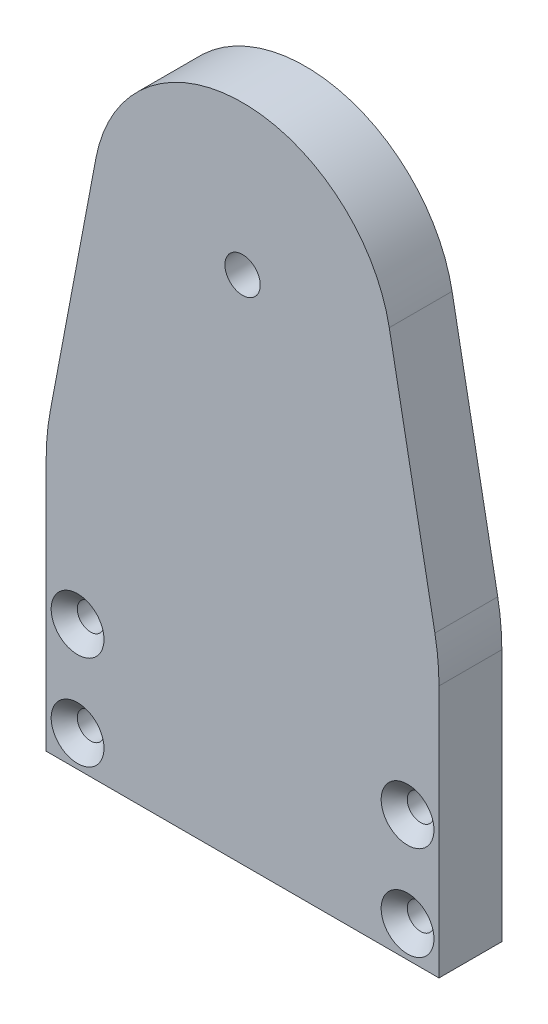
ISO-10303-21;
HEADER;
FILE_DESCRIPTION(('STEP AP214'),'2;1');
FILE_NAME('part.step','',(''),(''),'','','');
FILE_SCHEMA(('AUTOMOTIVE_DESIGN { 1 0 10303 214 1 1 1 1 }'));
ENDSEC;
DATA;
#1=APPLICATION_CONTEXT('core data for automotive mechanical design processes');
#2=APPLICATION_PROTOCOL_DEFINITION('international standard','automotive_design',2000,#1);
#3=PRODUCT_CONTEXT('',#1,'mechanical');
#4=PRODUCT('Part','Part','',(#3));
#5=PRODUCT_RELATED_PRODUCT_CATEGORY('part','',(#4));
#6=PRODUCT_DEFINITION_FORMATION('','',#4);
#7=PRODUCT_DEFINITION_CONTEXT('part definition',#1,'design');
#8=PRODUCT_DEFINITION('design','',#6,#7);
#9=PRODUCT_DEFINITION_SHAPE('','',#8);
#10=(LENGTH_UNIT() NAMED_UNIT(*) SI_UNIT(.MILLI.,.METRE.));
#11=(NAMED_UNIT(*) PLANE_ANGLE_UNIT() SI_UNIT($,.RADIAN.));
#12=(NAMED_UNIT(*) SI_UNIT($,.STERADIAN.) SOLID_ANGLE_UNIT());
#13=UNCERTAINTY_MEASURE_WITH_UNIT(LENGTH_MEASURE(1.E-05),#10,'distance_accuracy_value','');
#14=(GEOMETRIC_REPRESENTATION_CONTEXT(3) GLOBAL_UNCERTAINTY_ASSIGNED_CONTEXT((#13)) GLOBAL_UNIT_ASSIGNED_CONTEXT((#10,
#11,#12)) REPRESENTATION_CONTEXT('',''));
#15=CARTESIAN_POINT('',(0.,0.,0.));
#16=DIRECTION('',(0.,0.,1.));
#17=DIRECTION('',(1.,0.,0.));
#18=AXIS2_PLACEMENT_3D('',#15,#16,#17);
#19=CARTESIAN_POINT('',(54.6597712012296,10.3203083429222,8.));
#20=DIRECTION('',(-0.982638246920603,-0.185531872433835,0.));
#21=DIRECTION('',(0.185531872433835,-0.982638246920603,0.));
#22=AXIS2_PLACEMENT_3D('',#19,#20,#21);
#23=PLANE('',#22);
#24=DIRECTION('',(-0.185531872433835,0.982638246920603,0.));
#25=VECTOR('',#24,1.);
#26=CARTESIAN_POINT('',(54.6597712012296,10.3203083429222,8.));
#27=LINE('',#26,#25);
#28=CARTESIAN_POINT('',(49.4791474076181,37.7586078422442,8.));
#29=VERTEX_POINT('',#28);
#30=CARTESIAN_POINT('',(43.6701266914915,68.5251055762429,8.));
#31=VERTEX_POINT('',#30);
#32=EDGE_CURVE('E189',#29,#31,#27,.T.);
#33=ORIENTED_EDGE('',*,*,#32,.F.);
#34=DIRECTION('',(0.,0.,-1.));
#35=VECTOR('',#34,1.);
#36=CARTESIAN_POINT('',(49.4791474076181,37.7586078422442,8.));
#37=LINE('',#36,#35);
#38=CARTESIAN_POINT('',(49.4791474076181,37.7586078422442,0.));
#39=VERTEX_POINT('',#38);
#40=EDGE_CURVE('E58',#29,#39,#37,.T.);
#41=ORIENTED_EDGE('',*,*,#40,.T.);
#42=DIRECTION('',(-0.185531872433835,0.982638246920603,0.));
#43=VECTOR('',#42,1.);
#44=CARTESIAN_POINT('',(54.6597712012296,10.3203083429222,0.));
#45=LINE('',#44,#43);
#46=CARTESIAN_POINT('',(43.6701266914915,68.5251055762429,0.));
#47=VERTEX_POINT('',#46);
#48=EDGE_CURVE('E186',#39,#47,#45,.T.);
#49=ORIENTED_EDGE('',*,*,#48,.T.);
#50=DIRECTION('',(0.,0.,-1.));
#51=VECTOR('',#50,1.);
#52=CARTESIAN_POINT('',(43.6701266914915,68.5251055762429,8.));
#53=LINE('',#52,#51);
#54=EDGE_CURVE('E224',#31,#47,#53,.T.);
#55=ORIENTED_EDGE('',*,*,#54,.F.);
#56=EDGE_LOOP('',(#33,#41,#49,#55));
#57=FACE_BOUND('',#56,.T.);
#58=ADVANCED_FACE('F50',(#57),#23,.F.);
#59=CARTESIAN_POINT('',(25.,65.,8.));
#60=DIRECTION('',(0.,0.,-1.));
#61=DIRECTION('',(-1.,0.,0.));
#62=AXIS2_PLACEMENT_3D('',#59,#60,#61);
#63=CYLINDRICAL_SURFACE('',#62,19.);
#64=CARTESIAN_POINT('',(25.,65.,0.));
#65=DIRECTION('',(0.,0.,1.));
#66=DIRECTION('',(1.,0.,0.));
#67=AXIS2_PLACEMENT_3D('',#64,#65,#66);
#68=CIRCLE('',#67,19.);
#69=CARTESIAN_POINT('',(6.32987330850855,68.5251055762429,0.));
#70=VERTEX_POINT('',#69);
#71=EDGE_CURVE('E206',#47,#70,#68,.T.);
#72=ORIENTED_EDGE('',*,*,#71,.T.);
#73=DIRECTION('',(0.,0.,-1.));
#74=VECTOR('',#73,1.);
#75=CARTESIAN_POINT('',(6.32987330850855,68.5251055762429,8.));
#76=LINE('',#75,#74);
#77=CARTESIAN_POINT('',(6.32987330850855,68.5251055762429,8.));
#78=VERTEX_POINT('',#77);
#79=EDGE_CURVE('E221',#78,#70,#76,.T.);
#80=ORIENTED_EDGE('',*,*,#79,.F.);
#81=CARTESIAN_POINT('',(25.,65.,8.));
#82=DIRECTION('',(0.,0.,1.));
#83=DIRECTION('',(1.,0.,0.));
#84=AXIS2_PLACEMENT_3D('',#81,#82,#83);
#85=CIRCLE('',#84,19.);
#86=EDGE_CURVE('E191',#31,#78,#85,.T.);
#87=ORIENTED_EDGE('',*,*,#86,.F.);
#88=ORIENTED_EDGE('',*,*,#54,.T.);
#89=EDGE_LOOP('',(#72,#80,#87,#88));
#90=FACE_BOUND('',#89,.T.);
#91=ADVANCED_FACE('F252',(#90),#63,.T.);
#92=CARTESIAN_POINT('',(-6.38087498566982,1.20477264910817,8.));
#93=DIRECTION('',(-0.982638246920603,0.185531872433835,0.));
#94=DIRECTION('',(-0.185531872433835,-0.982638246920603,0.));
#95=AXIS2_PLACEMENT_3D('',#92,#93,#94);
#96=PLANE('',#95);
#97=DIRECTION('',(0.185531872433835,0.982638246920603,0.));
#98=VECTOR('',#97,1.);
#99=CARTESIAN_POINT('',(-6.38087498566982,1.20477264910817,0.));
#100=LINE('',#99,#98);
#101=CARTESIAN_POINT('',(0.520852592381923,37.7586078422442,0.));
#102=VERTEX_POINT('',#101);
#103=EDGE_CURVE('E209',#102,#70,#100,.T.);
#104=ORIENTED_EDGE('',*,*,#103,.F.);
#105=DIRECTION('',(0.,0.,-1.));
#106=VECTOR('',#105,1.);
#107=CARTESIAN_POINT('',(0.520852592381923,37.7586078422442,8.));
#108=LINE('',#107,#106);
#109=CARTESIAN_POINT('',(0.520852592381923,37.7586078422442,8.));
#110=VERTEX_POINT('',#109);
#111=EDGE_CURVE('E234',#102,#110,#108,.F.);
#112=ORIENTED_EDGE('',*,*,#111,.T.);
#113=DIRECTION('',(0.185531872433835,0.982638246920603,0.));
#114=VECTOR('',#113,1.);
#115=CARTESIAN_POINT('',(-6.38087498566982,1.20477264910817,8.));
#116=LINE('',#115,#114);
#117=EDGE_CURVE('E195',#110,#78,#116,.T.);
#118=ORIENTED_EDGE('',*,*,#117,.T.);
#119=ORIENTED_EDGE('',*,*,#79,.T.);
#120=EDGE_LOOP('',(#104,#112,#118,#119));
#121=FACE_BOUND('',#120,.T.);
#122=ADVANCED_FACE('F285',(#121),#96,.T.);
#123=CARTESIAN_POINT('',(0.,0.,8.));
#124=DIRECTION('',(-1.,0.,0.));
#125=DIRECTION('',(0.,0.,1.));
#126=AXIS2_PLACEMENT_3D('',#123,#124,#125);
#127=PLANE('',#126);
#128=DIRECTION('',(0.,1.,0.));
#129=VECTOR('',#128,1.);
#130=CARTESIAN_POINT('',(0.,0.,8.));
#131=LINE('',#130,#129);
#132=CARTESIAN_POINT('',(0.,0.,8.));
#133=VERTEX_POINT('',#132);
#134=CARTESIAN_POINT('',(0.,32.1926516692291,8.));
#135=VERTEX_POINT('',#134);
#136=EDGE_CURVE('E197',#133,#135,#131,.T.);
#137=ORIENTED_EDGE('',*,*,#136,.T.);
#138=DIRECTION('',(0.,0.,-1.));
#139=VECTOR('',#138,1.);
#140=CARTESIAN_POINT('',(0.,32.1926516692291,8.));
#141=LINE('',#140,#139);
#142=CARTESIAN_POINT('',(0.,32.1926516692291,0.));
#143=VERTEX_POINT('',#142);
#144=EDGE_CURVE('E227',#135,#143,#141,.T.);
#145=ORIENTED_EDGE('',*,*,#144,.T.);
#146=DIRECTION('',(0.,1.,0.));
#147=VECTOR('',#146,1.);
#148=CARTESIAN_POINT('',(0.,0.,0.));
#149=LINE('',#148,#147);
#150=CARTESIAN_POINT('',(0.,0.,0.));
#151=VERTEX_POINT('',#150);
#152=EDGE_CURVE('E211',#151,#143,#149,.T.);
#153=ORIENTED_EDGE('',*,*,#152,.F.);
#154=DIRECTION('',(0.,0.,-1.));
#155=VECTOR('',#154,1.);
#156=CARTESIAN_POINT('',(0.,0.,8.));
#157=LINE('',#156,#155);
#158=EDGE_CURVE('E219',#133,#151,#157,.T.);
#159=ORIENTED_EDGE('',*,*,#158,.F.);
#160=EDGE_LOOP('',(#137,#145,#153,#159));
#161=FACE_BOUND('',#160,.T.);
#162=ADVANCED_FACE('F264',(#161),#127,.T.);
#163=CARTESIAN_POINT('',(0.,0.,8.));
#164=DIRECTION('',(0.,1.,0.));
#165=DIRECTION('',(0.,0.,1.));
#166=AXIS2_PLACEMENT_3D('',#163,#164,#165);
#167=PLANE('',#166);
#168=CARTESIAN_POINT('',(38.,0.,4.));
#169=DIRECTION('',(0.,-1.,0.));
#170=DIRECTION('',(0.,0.,-1.));
#171=AXIS2_PLACEMENT_3D('',#168,#169,#170);
#172=CIRCLE('',#171,1.24999999999999);
#173=CARTESIAN_POINT('',(38.,0.,2.75000000000001));
#174=VERTEX_POINT('',#173);
#175=EDGE_CURVE('E130',#174,#174,#172,.T.);
#176=ORIENTED_EDGE('',*,*,#175,.F.);
#177=EDGE_LOOP('',(#176));
#178=FACE_BOUND('',#177,.T.);
#179=CARTESIAN_POINT('',(12.,0.,4.));
#180=DIRECTION('',(0.,-1.,0.));
#181=DIRECTION('',(0.,0.,-1.));
#182=AXIS2_PLACEMENT_3D('',#179,#180,#181);
#183=CIRCLE('',#182,1.24999999999999);
#184=CARTESIAN_POINT('',(12.,0.,2.75000000000001));
#185=VERTEX_POINT('',#184);
#186=EDGE_CURVE('E129',#185,#185,#183,.T.);
#187=ORIENTED_EDGE('',*,*,#186,.F.);
#188=EDGE_LOOP('',(#187));
#189=FACE_BOUND('',#188,.T.);
#190=DIRECTION('',(1.,0.,0.));
#191=VECTOR('',#190,1.);
#192=CARTESIAN_POINT('',(0.,0.,0.));
#193=LINE('',#192,#191);
#194=CARTESIAN_POINT('',(50.,0.,0.));
#195=VERTEX_POINT('',#194);
#196=EDGE_CURVE('E214',#151,#195,#193,.T.);
#197=ORIENTED_EDGE('',*,*,#196,.T.);
#198=DIRECTION('',(0.,0.,-1.));
#199=VECTOR('',#198,1.);
#200=CARTESIAN_POINT('',(50.,0.,8.));
#201=LINE('',#200,#199);
#202=CARTESIAN_POINT('',(50.,0.,8.));
#203=VERTEX_POINT('',#202);
#204=EDGE_CURVE('E204',#203,#195,#201,.T.);
#205=ORIENTED_EDGE('',*,*,#204,.F.);
#206=DIRECTION('',(1.,0.,0.));
#207=VECTOR('',#206,1.);
#208=CARTESIAN_POINT('',(0.,0.,8.));
#209=LINE('',#208,#207);
#210=EDGE_CURVE('E200',#133,#203,#209,.T.);
#211=ORIENTED_EDGE('',*,*,#210,.F.);
#212=ORIENTED_EDGE('',*,*,#158,.T.);
#213=EDGE_LOOP('',(#197,#205,#211,#212));
#214=FACE_BOUND('',#213,.T.);
#215=ADVANCED_FACE('F268',(#178,#189,#214),#167,.F.);
#216=CARTESIAN_POINT('',(50.,0.,8.));
#217=DIRECTION('',(-1.,0.,0.));
#218=DIRECTION('',(0.,0.,1.));
#219=AXIS2_PLACEMENT_3D('',#216,#217,#218);
#220=PLANE('',#219);
#221=DIRECTION('',(0.,1.,0.));
#222=VECTOR('',#221,1.);
#223=CARTESIAN_POINT('',(50.,0.,0.));
#224=LINE('',#223,#222);
#225=CARTESIAN_POINT('',(50.,32.1926516692292,0.));
#226=VERTEX_POINT('',#225);
#227=EDGE_CURVE('E192',#195,#226,#224,.T.);
#228=ORIENTED_EDGE('',*,*,#227,.T.);
#229=DIRECTION('',(0.,0.,-1.));
#230=VECTOR('',#229,1.);
#231=CARTESIAN_POINT('',(50.,32.1926516692292,8.));
#232=LINE('',#231,#230);
#233=CARTESIAN_POINT('',(50.,32.1926516692292,8.));
#234=VERTEX_POINT('',#233);
#235=EDGE_CURVE('E13',#226,#234,#232,.F.);
#236=ORIENTED_EDGE('',*,*,#235,.T.);
#237=DIRECTION('',(0.,1.,0.));
#238=VECTOR('',#237,1.);
#239=CARTESIAN_POINT('',(50.,0.,8.));
#240=LINE('',#239,#238);
#241=EDGE_CURVE('E202',#203,#234,#240,.T.);
#242=ORIENTED_EDGE('',*,*,#241,.F.);
#243=ORIENTED_EDGE('',*,*,#204,.T.);
#244=EDGE_LOOP('',(#228,#236,#242,#243));
#245=FACE_BOUND('',#244,.T.);
#246=ADVANCED_FACE('F270',(#245),#220,.F.);
#247=CARTESIAN_POINT('',(0.,0.,8.));
#248=DIRECTION('',(0.,0.,1.));
#249=DIRECTION('',(1.,0.,0.));
#250=AXIS2_PLACEMENT_3D('',#247,#248,#249);
#251=PLANE('',#250);
#252=CARTESIAN_POINT('',(4.,16.,8.));
#253=DIRECTION('',(0.,0.,1.));
#254=DIRECTION('',(1.,0.,0.));
#255=AXIS2_PLACEMENT_3D('',#252,#253,#254);
#256=CIRCLE('',#255,3.36);
#257=CARTESIAN_POINT('',(7.36,16.,8.));
#258=VERTEX_POINT('',#257);
#259=EDGE_CURVE('E140',#258,#258,#256,.T.);
#260=ORIENTED_EDGE('',*,*,#259,.F.);
#261=EDGE_LOOP('',(#260));
#262=FACE_BOUND('',#261,.T.);
#263=CARTESIAN_POINT('',(4.,4.,8.));
#264=DIRECTION('',(0.,0.,1.));
#265=DIRECTION('',(1.,0.,0.));
#266=AXIS2_PLACEMENT_3D('',#263,#264,#265);
#267=CIRCLE('',#266,3.36);
#268=CARTESIAN_POINT('',(7.36,4.,8.));
#269=VERTEX_POINT('',#268);
#270=EDGE_CURVE('E149',#269,#269,#267,.T.);
#271=ORIENTED_EDGE('',*,*,#270,.F.);
#272=EDGE_LOOP('',(#271));
#273=FACE_BOUND('',#272,.T.);
#274=CARTESIAN_POINT('',(46.,4.,8.));
#275=DIRECTION('',(0.,0.,1.));
#276=DIRECTION('',(1.,0.,0.));
#277=AXIS2_PLACEMENT_3D('',#274,#275,#276);
#278=CIRCLE('',#277,3.36);
#279=CARTESIAN_POINT('',(49.36,4.,8.));
#280=VERTEX_POINT('',#279);
#281=EDGE_CURVE('E158',#280,#280,#278,.T.);
#282=ORIENTED_EDGE('',*,*,#281,.F.);
#283=EDGE_LOOP('',(#282));
#284=FACE_BOUND('',#283,.T.);
#285=CARTESIAN_POINT('',(46.,16.,8.));
#286=DIRECTION('',(0.,0.,1.));
#287=DIRECTION('',(1.,0.,0.));
#288=AXIS2_PLACEMENT_3D('',#285,#286,#287);
#289=CIRCLE('',#288,3.36);
#290=CARTESIAN_POINT('',(49.36,16.,8.));
#291=VERTEX_POINT('',#290);
#292=EDGE_CURVE('E167',#291,#291,#289,.T.);
#293=ORIENTED_EDGE('',*,*,#292,.F.);
#294=EDGE_LOOP('',(#293));
#295=FACE_BOUND('',#294,.T.);
#296=CARTESIAN_POINT('',(25.,65.,8.));
#297=DIRECTION('',(0.,0.,1.));
#298=DIRECTION('',(1.,0.,0.));
#299=AXIS2_PLACEMENT_3D('',#296,#297,#298);
#300=CIRCLE('',#299,2.24999999999999);
#301=CARTESIAN_POINT('',(27.25,65.,8.));
#302=VERTEX_POINT('',#301);
#303=EDGE_CURVE('E176',#302,#302,#300,.T.);
#304=ORIENTED_EDGE('',*,*,#303,.F.);
#305=EDGE_LOOP('',(#304));
#306=FACE_BOUND('',#305,.T.);
#307=ORIENTED_EDGE('',*,*,#117,.F.);
#308=CARTESIAN_POINT('',(30.,32.1926516692291,8.));
#309=DIRECTION('',(0.,0.,1.));
#310=DIRECTION('',(1.,0.,0.));
#311=AXIS2_PLACEMENT_3D('',#308,#309,#310);
#312=CIRCLE('',#311,30.);
#313=EDGE_CURVE('E237',#110,#135,#312,.T.);
#314=ORIENTED_EDGE('',*,*,#313,.T.);
#315=ORIENTED_EDGE('',*,*,#136,.F.);
#316=ORIENTED_EDGE('',*,*,#210,.T.);
#317=ORIENTED_EDGE('',*,*,#241,.T.);
#318=CARTESIAN_POINT('',(20.,32.1926516692292,8.));
#319=DIRECTION('',(0.,0.,1.));
#320=DIRECTION('',(1.,0.,0.));
#321=AXIS2_PLACEMENT_3D('',#318,#319,#320);
#322=CIRCLE('',#321,30.);
#323=EDGE_CURVE('E70',#234,#29,#322,.T.);
#324=ORIENTED_EDGE('',*,*,#323,.T.);
#325=ORIENTED_EDGE('',*,*,#32,.T.);
#326=ORIENTED_EDGE('',*,*,#86,.T.);
#327=EDGE_LOOP('',(#307,#314,#315,#316,#317,#324,#325,#326));
#328=FACE_BOUND('',#327,.T.);
#329=ADVANCED_FACE('F254',(#262,#273,#284,#295,#306,#328),#251,.T.);
#330=CARTESIAN_POINT('',(0.,0.,0.));
#331=DIRECTION('',(0.,0.,1.));
#332=DIRECTION('',(1.,0.,0.));
#333=AXIS2_PLACEMENT_3D('',#330,#331,#332);
#334=PLANE('',#333);
#335=CARTESIAN_POINT('',(4.,16.,0.));
#336=DIRECTION('',(0.,0.,1.));
#337=DIRECTION('',(1.,0.,0.));
#338=AXIS2_PLACEMENT_3D('',#335,#336,#337);
#339=CIRCLE('',#338,1.7);
#340=CARTESIAN_POINT('',(5.7,16.,0.));
#341=VERTEX_POINT('',#340);
#342=EDGE_CURVE('E146',#341,#341,#339,.T.);
#343=ORIENTED_EDGE('',*,*,#342,.T.);
#344=EDGE_LOOP('',(#343));
#345=FACE_BOUND('',#344,.T.);
#346=CARTESIAN_POINT('',(4.,4.,0.));
#347=DIRECTION('',(0.,0.,1.));
#348=DIRECTION('',(1.,0.,0.));
#349=AXIS2_PLACEMENT_3D('',#346,#347,#348);
#350=CIRCLE('',#349,1.7);
#351=CARTESIAN_POINT('',(5.7,4.,0.));
#352=VERTEX_POINT('',#351);
#353=EDGE_CURVE('E155',#352,#352,#350,.T.);
#354=ORIENTED_EDGE('',*,*,#353,.T.);
#355=EDGE_LOOP('',(#354));
#356=FACE_BOUND('',#355,.T.);
#357=CARTESIAN_POINT('',(46.,4.,0.));
#358=DIRECTION('',(0.,0.,1.));
#359=DIRECTION('',(1.,0.,0.));
#360=AXIS2_PLACEMENT_3D('',#357,#358,#359);
#361=CIRCLE('',#360,1.7);
#362=CARTESIAN_POINT('',(47.7,4.,0.));
#363=VERTEX_POINT('',#362);
#364=EDGE_CURVE('E164',#363,#363,#361,.T.);
#365=ORIENTED_EDGE('',*,*,#364,.T.);
#366=EDGE_LOOP('',(#365));
#367=FACE_BOUND('',#366,.T.);
#368=CARTESIAN_POINT('',(46.,16.,0.));
#369=DIRECTION('',(0.,0.,1.));
#370=DIRECTION('',(1.,0.,0.));
#371=AXIS2_PLACEMENT_3D('',#368,#369,#370);
#372=CIRCLE('',#371,1.7);
#373=CARTESIAN_POINT('',(47.7,16.,0.));
#374=VERTEX_POINT('',#373);
#375=EDGE_CURVE('E173',#374,#374,#372,.T.);
#376=ORIENTED_EDGE('',*,*,#375,.T.);
#377=EDGE_LOOP('',(#376));
#378=FACE_BOUND('',#377,.T.);
#379=CARTESIAN_POINT('',(25.,65.,0.));
#380=DIRECTION('',(0.,0.,-1.));
#381=DIRECTION('',(-1.,0.,0.));
#382=AXIS2_PLACEMENT_3D('',#379,#380,#381);
#383=CIRCLE('',#382,14.);
#384=CARTESIAN_POINT('',(11.,65.,0.));
#385=VERTEX_POINT('',#384);
#386=EDGE_CURVE('E182',#385,#385,#383,.T.);
#387=ORIENTED_EDGE('',*,*,#386,.F.);
#388=EDGE_LOOP('',(#387));
#389=FACE_BOUND('',#388,.T.);
#390=ORIENTED_EDGE('',*,*,#152,.T.);
#391=CARTESIAN_POINT('',(30.,32.1926516692291,0.));
#392=DIRECTION('',(0.,0.,1.));
#393=DIRECTION('',(1.,0.,0.));
#394=AXIS2_PLACEMENT_3D('',#391,#392,#393);
#395=CIRCLE('',#394,30.);
#396=EDGE_CURVE('E232',#143,#102,#395,.F.);
#397=ORIENTED_EDGE('',*,*,#396,.T.);
#398=ORIENTED_EDGE('',*,*,#103,.T.);
#399=ORIENTED_EDGE('',*,*,#71,.F.);
#400=ORIENTED_EDGE('',*,*,#48,.F.);
#401=CARTESIAN_POINT('',(20.,32.1926516692292,0.));
#402=DIRECTION('',(0.,0.,1.));
#403=DIRECTION('',(1.,0.,0.));
#404=AXIS2_PLACEMENT_3D('',#401,#402,#403);
#405=CIRCLE('',#404,30.);
#406=EDGE_CURVE('E230',#39,#226,#405,.F.);
#407=ORIENTED_EDGE('',*,*,#406,.T.);
#408=ORIENTED_EDGE('',*,*,#227,.F.);
#409=ORIENTED_EDGE('',*,*,#196,.F.);
#410=EDGE_LOOP('',(#390,#397,#398,#399,#400,#407,#408,#409));
#411=FACE_BOUND('',#410,.T.);
#412=ADVANCED_FACE('F246',(#345,#356,#367,#378,#389,#411),#334,.F.);
#413=CARTESIAN_POINT('',(30.,32.1926516692291,8.));
#414=DIRECTION('',(0.,0.,-1.));
#415=DIRECTION('',(-1.,0.,0.));
#416=AXIS2_PLACEMENT_3D('',#413,#414,#415);
#417=CYLINDRICAL_SURFACE('',#416,30.);
#418=ORIENTED_EDGE('',*,*,#313,.F.);
#419=ORIENTED_EDGE('',*,*,#111,.F.);
#420=ORIENTED_EDGE('',*,*,#396,.F.);
#421=ORIENTED_EDGE('',*,*,#144,.F.);
#422=EDGE_LOOP('',(#418,#419,#420,#421));
#423=FACE_BOUND('',#422,.T.);
#424=ADVANCED_FACE('F261',(#423),#417,.T.);
#425=CARTESIAN_POINT('',(20.,32.1926516692292,8.));
#426=DIRECTION('',(0.,0.,-1.));
#427=DIRECTION('',(-1.,0.,0.));
#428=AXIS2_PLACEMENT_3D('',#425,#426,#427);
#429=CYLINDRICAL_SURFACE('',#428,30.);
#430=ORIENTED_EDGE('',*,*,#323,.F.);
#431=ORIENTED_EDGE('',*,*,#235,.F.);
#432=ORIENTED_EDGE('',*,*,#406,.F.);
#433=ORIENTED_EDGE('',*,*,#40,.F.);
#434=EDGE_LOOP('',(#430,#431,#432,#433));
#435=FACE_BOUND('',#434,.T.);
#436=ADVANCED_FACE('F52',(#435),#429,.T.);
#437=CARTESIAN_POINT('',(25.,65.,4.));
#438=DIRECTION('',(0.,0.,-1.));
#439=DIRECTION('',(-1.,0.,0.));
#440=AXIS2_PLACEMENT_3D('',#437,#438,#439);
#441=CYLINDRICAL_SURFACE('',#440,14.);
#442=CARTESIAN_POINT('',(25.,65.,4.));
#443=DIRECTION('',(0.,0.,-1.));
#444=DIRECTION('',(-1.,0.,0.));
#445=AXIS2_PLACEMENT_3D('',#442,#443,#444);
#446=CIRCLE('',#445,14.);
#447=CARTESIAN_POINT('',(11.,65.,4.));
#448=VERTEX_POINT('',#447);
#449=EDGE_CURVE('E183',#448,#448,#446,.T.);
#450=ORIENTED_EDGE('',*,*,#449,.F.);
#451=EDGE_LOOP('',(#450));
#452=FACE_BOUND('',#451,.T.);
#453=ORIENTED_EDGE('',*,*,#386,.T.);
#454=EDGE_LOOP('',(#453));
#455=FACE_BOUND('',#454,.T.);
#456=ADVANCED_FACE('F272',(#452,#455),#441,.F.);
#457=CARTESIAN_POINT('',(0.,0.,4.));
#458=DIRECTION('',(0.,0.,-1.));
#459=DIRECTION('',(-1.,0.,0.));
#460=AXIS2_PLACEMENT_3D('',#457,#458,#459);
#461=PLANE('',#460);
#462=CARTESIAN_POINT('',(25.,65.,4.));
#463=DIRECTION('',(0.,0.,-1.));
#464=DIRECTION('',(-1.,0.,0.));
#465=AXIS2_PLACEMENT_3D('',#462,#463,#464);
#466=CIRCLE('',#465,2.24999999999999);
#467=CARTESIAN_POINT('',(22.75,65.,4.));
#468=VERTEX_POINT('',#467);
#469=EDGE_CURVE('E179',#468,#468,#466,.T.);
#470=ORIENTED_EDGE('',*,*,#469,.F.);
#471=EDGE_LOOP('',(#470));
#472=FACE_BOUND('',#471,.T.);
#473=ORIENTED_EDGE('',*,*,#449,.T.);
#474=EDGE_LOOP('',(#473));
#475=FACE_BOUND('',#474,.T.);
#476=ADVANCED_FACE('F277',(#472,#475),#461,.T.);
#477=CARTESIAN_POINT('',(25.,65.,8.));
#478=DIRECTION('',(0.,0.,1.));
#479=DIRECTION('',(1.,0.,0.));
#480=AXIS2_PLACEMENT_3D('',#477,#478,#479);
#481=CYLINDRICAL_SURFACE('',#480,2.24999999999999);
#482=ORIENTED_EDGE('',*,*,#469,.T.);
#483=EDGE_LOOP('',(#482));
#484=FACE_BOUND('',#483,.T.);
#485=ORIENTED_EDGE('',*,*,#303,.T.);
#486=EDGE_LOOP('',(#485));
#487=FACE_BOUND('',#486,.T.);
#488=ADVANCED_FACE('F305',(#484,#487),#481,.F.);
#489=CARTESIAN_POINT('',(46.,16.,8.));
#490=DIRECTION('',(0.,0.,1.));
#491=DIRECTION('',(1.,0.,0.));
#492=AXIS2_PLACEMENT_3D('',#489,#490,#491);
#493=CYLINDRICAL_SURFACE('',#492,1.7);
#494=ORIENTED_EDGE('',*,*,#375,.F.);
#495=EDGE_LOOP('',(#494));
#496=FACE_BOUND('',#495,.T.);
#497=CARTESIAN_POINT('',(46.,16.,6.34));
#498=DIRECTION('',(0.,0.,1.));
#499=DIRECTION('',(1.,0.,0.));
#500=AXIS2_PLACEMENT_3D('',#497,#498,#499);
#501=CIRCLE('',#500,1.7);
#502=CARTESIAN_POINT('',(47.7,16.,6.34));
#503=VERTEX_POINT('',#502);
#504=EDGE_CURVE('E170',#503,#503,#501,.T.);
#505=ORIENTED_EDGE('',*,*,#504,.T.);
#506=EDGE_LOOP('',(#505));
#507=FACE_BOUND('',#506,.T.);
#508=ADVANCED_FACE('F309',(#496,#507),#493,.F.);
#509=CARTESIAN_POINT('',(46.,16.,8.));
#510=DIRECTION('',(0.,0.,1.));
#511=DIRECTION('',(1.,0.,0.));
#512=AXIS2_PLACEMENT_3D('',#509,#510,#511);
#513=CONICAL_SURFACE('',#512,3.36,0.785398163397449);
#514=ORIENTED_EDGE('',*,*,#504,.F.);
#515=EDGE_LOOP('',(#514));
#516=FACE_BOUND('',#515,.T.);
#517=ORIENTED_EDGE('',*,*,#292,.T.);
#518=EDGE_LOOP('',(#517));
#519=FACE_BOUND('',#518,.T.);
#520=ADVANCED_FACE('F313',(#516,#519),#513,.F.);
#521=CARTESIAN_POINT('',(46.,4.,8.));
#522=DIRECTION('',(0.,0.,1.));
#523=DIRECTION('',(1.,0.,0.));
#524=AXIS2_PLACEMENT_3D('',#521,#522,#523);
#525=CYLINDRICAL_SURFACE('',#524,1.7);
#526=ORIENTED_EDGE('',*,*,#364,.F.);
#527=EDGE_LOOP('',(#526));
#528=FACE_BOUND('',#527,.T.);
#529=CARTESIAN_POINT('',(46.,4.,6.34));
#530=DIRECTION('',(0.,0.,1.));
#531=DIRECTION('',(1.,0.,0.));
#532=AXIS2_PLACEMENT_3D('',#529,#530,#531);
#533=CIRCLE('',#532,1.7);
#534=CARTESIAN_POINT('',(47.7,4.,6.34));
#535=VERTEX_POINT('',#534);
#536=EDGE_CURVE('E161',#535,#535,#533,.T.);
#537=ORIENTED_EDGE('',*,*,#536,.T.);
#538=EDGE_LOOP('',(#537));
#539=FACE_BOUND('',#538,.T.);
#540=ADVANCED_FACE('F317',(#528,#539),#525,.F.);
#541=CARTESIAN_POINT('',(46.,4.,8.));
#542=DIRECTION('',(0.,0.,1.));
#543=DIRECTION('',(1.,0.,0.));
#544=AXIS2_PLACEMENT_3D('',#541,#542,#543);
#545=CONICAL_SURFACE('',#544,3.36,0.785398163397449);
#546=ORIENTED_EDGE('',*,*,#536,.F.);
#547=EDGE_LOOP('',(#546));
#548=FACE_BOUND('',#547,.T.);
#549=ORIENTED_EDGE('',*,*,#281,.T.);
#550=EDGE_LOOP('',(#549));
#551=FACE_BOUND('',#550,.T.);
#552=ADVANCED_FACE('F321',(#548,#551),#545,.F.);
#553=CARTESIAN_POINT('',(4.,4.,8.));
#554=DIRECTION('',(0.,0.,1.));
#555=DIRECTION('',(1.,0.,0.));
#556=AXIS2_PLACEMENT_3D('',#553,#554,#555);
#557=CYLINDRICAL_SURFACE('',#556,1.7);
#558=ORIENTED_EDGE('',*,*,#353,.F.);
#559=EDGE_LOOP('',(#558));
#560=FACE_BOUND('',#559,.T.);
#561=CARTESIAN_POINT('',(4.,4.,6.34));
#562=DIRECTION('',(0.,0.,1.));
#563=DIRECTION('',(1.,0.,0.));
#564=AXIS2_PLACEMENT_3D('',#561,#562,#563);
#565=CIRCLE('',#564,1.7);
#566=CARTESIAN_POINT('',(5.7,4.,6.34));
#567=VERTEX_POINT('',#566);
#568=EDGE_CURVE('E152',#567,#567,#565,.T.);
#569=ORIENTED_EDGE('',*,*,#568,.T.);
#570=EDGE_LOOP('',(#569));
#571=FACE_BOUND('',#570,.T.);
#572=ADVANCED_FACE('F325',(#560,#571),#557,.F.);
#573=CARTESIAN_POINT('',(4.,4.,8.));
#574=DIRECTION('',(0.,0.,1.));
#575=DIRECTION('',(1.,0.,0.));
#576=AXIS2_PLACEMENT_3D('',#573,#574,#575);
#577=CONICAL_SURFACE('',#576,3.36,0.785398163397449);
#578=ORIENTED_EDGE('',*,*,#568,.F.);
#579=EDGE_LOOP('',(#578));
#580=FACE_BOUND('',#579,.T.);
#581=ORIENTED_EDGE('',*,*,#270,.T.);
#582=EDGE_LOOP('',(#581));
#583=FACE_BOUND('',#582,.T.);
#584=ADVANCED_FACE('F329',(#580,#583),#577,.F.);
#585=CARTESIAN_POINT('',(4.,16.,8.));
#586=DIRECTION('',(0.,0.,1.));
#587=DIRECTION('',(1.,0.,0.));
#588=AXIS2_PLACEMENT_3D('',#585,#586,#587);
#589=CYLINDRICAL_SURFACE('',#588,1.7);
#590=ORIENTED_EDGE('',*,*,#342,.F.);
#591=EDGE_LOOP('',(#590));
#592=FACE_BOUND('',#591,.T.);
#593=CARTESIAN_POINT('',(4.,16.,6.34));
#594=DIRECTION('',(0.,0.,1.));
#595=DIRECTION('',(1.,0.,0.));
#596=AXIS2_PLACEMENT_3D('',#593,#594,#595);
#597=CIRCLE('',#596,1.7);
#598=CARTESIAN_POINT('',(5.7,16.,6.34));
#599=VERTEX_POINT('',#598);
#600=EDGE_CURVE('E143',#599,#599,#597,.T.);
#601=ORIENTED_EDGE('',*,*,#600,.T.);
#602=EDGE_LOOP('',(#601));
#603=FACE_BOUND('',#602,.T.);
#604=ADVANCED_FACE('F333',(#592,#603),#589,.F.);
#605=CARTESIAN_POINT('',(4.,16.,8.));
#606=DIRECTION('',(0.,0.,1.));
#607=DIRECTION('',(1.,0.,0.));
#608=AXIS2_PLACEMENT_3D('',#605,#606,#607);
#609=CONICAL_SURFACE('',#608,3.36,0.785398163397449);
#610=ORIENTED_EDGE('',*,*,#600,.F.);
#611=EDGE_LOOP('',(#610));
#612=FACE_BOUND('',#611,.T.);
#613=ORIENTED_EDGE('',*,*,#259,.T.);
#614=EDGE_LOOP('',(#613));
#615=FACE_BOUND('',#614,.T.);
#616=ADVANCED_FACE('F337',(#612,#615),#609,.F.);
#617=CARTESIAN_POINT('',(12.,8.50000000000001,4.));
#618=DIRECTION('',(0.,-1.,0.));
#619=DIRECTION('',(0.,0.,-1.));
#620=AXIS2_PLACEMENT_3D('',#617,#618,#619);
#621=CONICAL_SURFACE('',#620,1.24999999999999,1.02974425867665);
#622=CARTESIAN_POINT('',(12.,9.25107577378445,4.));
#623=VERTEX_POINT('',#622);
#624=VERTEX_LOOP('',#623);
#625=FACE_BOUND('',#624,.T.);
#626=CARTESIAN_POINT('',(12.,8.50000000000001,4.));
#627=DIRECTION('',(0.,-1.,0.));
#628=DIRECTION('',(0.,0.,-1.));
#629=AXIS2_PLACEMENT_3D('',#626,#627,#628);
#630=CIRCLE('',#629,1.24999999999999);
#631=CARTESIAN_POINT('',(12.,8.50000000000001,2.75000000000001));
#632=VERTEX_POINT('',#631);
#633=EDGE_CURVE('E133',#632,#632,#630,.T.);
#634=ORIENTED_EDGE('',*,*,#633,.T.);
#635=EDGE_LOOP('',(#634));
#636=FACE_BOUND('',#635,.T.);
#637=ADVANCED_FACE('F341',(#625,#636),#621,.F.);
#638=CARTESIAN_POINT('',(12.,0.,4.));
#639=DIRECTION('',(0.,-1.,0.));
#640=DIRECTION('',(0.,0.,-1.));
#641=AXIS2_PLACEMENT_3D('',#638,#639,#640);
#642=CYLINDRICAL_SURFACE('',#641,1.24999999999999);
#643=ORIENTED_EDGE('',*,*,#633,.F.);
#644=EDGE_LOOP('',(#643));
#645=FACE_BOUND('',#644,.T.);
#646=ORIENTED_EDGE('',*,*,#186,.T.);
#647=EDGE_LOOP('',(#646));
#648=FACE_BOUND('',#647,.T.);
#649=ADVANCED_FACE('F123',(#645,#648),#642,.F.);
#650=CARTESIAN_POINT('',(38.,8.50000000000001,4.));
#651=DIRECTION('',(0.,-1.,0.));
#652=DIRECTION('',(0.,0.,-1.));
#653=AXIS2_PLACEMENT_3D('',#650,#651,#652);
#654=CONICAL_SURFACE('',#653,1.24999999999999,1.02974425867665);
#655=CARTESIAN_POINT('',(38.,9.25107577378445,4.));
#656=VERTEX_POINT('',#655);
#657=VERTEX_LOOP('',#656);
#658=FACE_BOUND('',#657,.T.);
#659=CARTESIAN_POINT('',(38.,8.50000000000001,4.));
#660=DIRECTION('',(0.,-1.,0.));
#661=DIRECTION('',(0.,0.,-1.));
#662=AXIS2_PLACEMENT_3D('',#659,#660,#661);
#663=CIRCLE('',#662,1.24999999999999);
#664=CARTESIAN_POINT('',(38.,8.50000000000001,2.75000000000001));
#665=VERTEX_POINT('',#664);
#666=EDGE_CURVE('E127',#665,#665,#663,.T.);
#667=ORIENTED_EDGE('',*,*,#666,.T.);
#668=EDGE_LOOP('',(#667));
#669=FACE_BOUND('',#668,.T.);
#670=ADVANCED_FACE('F119',(#658,#669),#654,.F.);
#671=CARTESIAN_POINT('',(38.,0.,4.));
#672=DIRECTION('',(0.,-1.,0.));
#673=DIRECTION('',(0.,0.,-1.));
#674=AXIS2_PLACEMENT_3D('',#671,#672,#673);
#675=CYLINDRICAL_SURFACE('',#674,1.24999999999999);
#676=ORIENTED_EDGE('',*,*,#666,.F.);
#677=EDGE_LOOP('',(#676));
#678=FACE_BOUND('',#677,.T.);
#679=ORIENTED_EDGE('',*,*,#175,.T.);
#680=EDGE_LOOP('',(#679));
#681=FACE_BOUND('',#680,.T.);
#682=ADVANCED_FACE('F122',(#678,#681),#675,.F.);
#683=CLOSED_SHELL('',(#58,#91,#122,#162,#215,#246,#329,#412,#424,#436,#456,#476,#488,#508,#520,
#540,#552,#572,#584,#604,#616,#637,#649,#670,#682));
#684=MANIFOLD_SOLID_BREP('B2',#683);
#685=ADVANCED_BREP_SHAPE_REPRESENTATION('',(#18,#684),#14);
#686=SHAPE_DEFINITION_REPRESENTATION(#9,#685);
ENDSEC;
END-ISO-10303-21;
